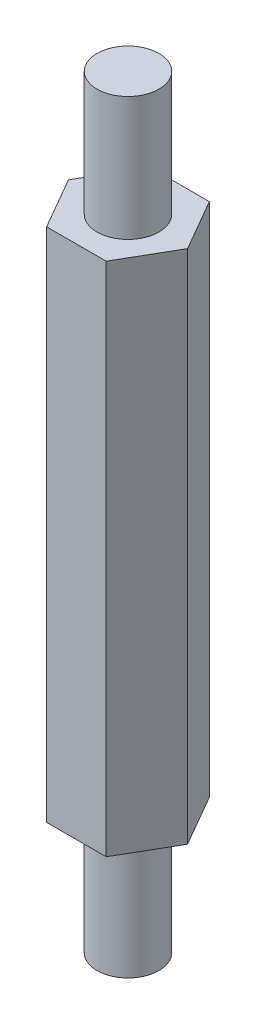
ISO-10303-21;
HEADER;
FILE_DESCRIPTION(('STEP AP214'),'2;1');
FILE_NAME('part.step','',(''),(''),'','','');
FILE_SCHEMA(('AUTOMOTIVE_DESIGN { 1 0 10303 214 1 1 1 1 }'));
ENDSEC;
DATA;
#1=APPLICATION_CONTEXT('core data for automotive mechanical design processes');
#2=APPLICATION_PROTOCOL_DEFINITION('international standard','automotive_design',2000,#1);
#3=PRODUCT_CONTEXT('',#1,'mechanical');
#4=PRODUCT('Part','Part','',(#3));
#5=PRODUCT_RELATED_PRODUCT_CATEGORY('part','',(#4));
#6=PRODUCT_DEFINITION_FORMATION('','',#4);
#7=PRODUCT_DEFINITION_CONTEXT('part definition',#1,'design');
#8=PRODUCT_DEFINITION('design','',#6,#7);
#9=PRODUCT_DEFINITION_SHAPE('','',#8);
#10=(LENGTH_UNIT() NAMED_UNIT(*) SI_UNIT(.MILLI.,.METRE.));
#11=(NAMED_UNIT(*) PLANE_ANGLE_UNIT() SI_UNIT($,.RADIAN.));
#12=(NAMED_UNIT(*) SI_UNIT($,.STERADIAN.) SOLID_ANGLE_UNIT());
#13=UNCERTAINTY_MEASURE_WITH_UNIT(LENGTH_MEASURE(1.E-05),#10,'distance_accuracy_value','');
#14=(GEOMETRIC_REPRESENTATION_CONTEXT(3) GLOBAL_UNCERTAINTY_ASSIGNED_CONTEXT((#13)) GLOBAL_UNIT_ASSIGNED_CONTEXT((#10,
#11,#12)) REPRESENTATION_CONTEXT('',''));
#15=CARTESIAN_POINT('',(0.,0.,0.));
#16=DIRECTION('',(0.,0.,1.));
#17=DIRECTION('',(1.,0.,0.));
#18=AXIS2_PLACEMENT_3D('',#15,#16,#17);
#19=CARTESIAN_POINT('',(0.,-6.,0.));
#20=DIRECTION('',(0.,-1.,0.));
#21=DIRECTION('',(1.,0.,0.));
#22=AXIS2_PLACEMENT_3D('',#19,#20,#21);
#23=PLANE('',#22);
#24=CARTESIAN_POINT('',(0.,-6.,0.));
#25=DIRECTION('',(0.,-1.,0.));
#26=DIRECTION('',(1.,0.,0.));
#27=AXIS2_PLACEMENT_3D('',#24,#25,#26);
#28=CIRCLE('',#27,1.5);
#29=CARTESIAN_POINT('',(1.5,-6.,0.));
#30=VERTEX_POINT('',#29);
#31=EDGE_CURVE('E19',#30,#30,#28,.F.);
#32=ORIENTED_EDGE('',*,*,#31,.F.);
#33=EDGE_LOOP('',(#32));
#34=FACE_BOUND('',#33,.T.);
#35=ADVANCED_FACE('F16',(#34),#23,.T.);
#36=CARTESIAN_POINT('',(1.49999999999999,31.,0.));
#37=DIRECTION('',(0.,1.,0.));
#38=DIRECTION('',(-1.,0.,0.));
#39=AXIS2_PLACEMENT_3D('',#36,#37,#38);
#40=PLANE('',#39);
#41=CARTESIAN_POINT('',(0.,31.,0.));
#42=DIRECTION('',(0.,-1.,0.));
#43=DIRECTION('',(1.,0.,0.));
#44=AXIS2_PLACEMENT_3D('',#41,#42,#43);
#45=CIRCLE('',#44,1.5);
#46=CARTESIAN_POINT('',(1.5,31.,0.));
#47=VERTEX_POINT('',#46);
#48=EDGE_CURVE('E85',#47,#47,#45,.T.);
#49=ORIENTED_EDGE('',*,*,#48,.F.);
#50=EDGE_LOOP('',(#49));
#51=FACE_BOUND('',#50,.T.);
#52=ADVANCED_FACE('F110',(#51),#40,.T.);
#53=CARTESIAN_POINT('',(0.,-3.,0.));
#54=DIRECTION('',(0.,-1.,0.));
#55=DIRECTION('',(1.,0.,0.));
#56=AXIS2_PLACEMENT_3D('',#53,#54,#55);
#57=CYLINDRICAL_SURFACE('',#56,1.5);
#58=CARTESIAN_POINT('',(0.,0.,0.));
#59=DIRECTION('',(0.,-1.,0.));
#60=DIRECTION('',(1.,0.,0.));
#61=AXIS2_PLACEMENT_3D('',#58,#59,#60);
#62=CIRCLE('',#61,1.5);
#63=CARTESIAN_POINT('',(1.5,0.,0.));
#64=VERTEX_POINT('',#63);
#65=EDGE_CURVE('E92',#64,#64,#62,.T.);
#66=ORIENTED_EDGE('',*,*,#65,.T.);
#67=EDGE_LOOP('',(#66));
#68=FACE_BOUND('',#67,.T.);
#69=ORIENTED_EDGE('',*,*,#31,.T.);
#70=EDGE_LOOP('',(#69));
#71=FACE_BOUND('',#70,.T.);
#72=ADVANCED_FACE('F112',(#68,#71),#57,.T.);
#73=CARTESIAN_POINT('',(-1.44337567297406,0.,2.5));
#74=DIRECTION('',(0.,0.,1.));
#75=DIRECTION('',(1.,0.,0.));
#76=AXIS2_PLACEMENT_3D('',#73,#74,#75);
#77=PLANE('',#76);
#78=DIRECTION('',(1.,0.,0.));
#79=VECTOR('',#78,1.);
#80=CARTESIAN_POINT('',(0.,25.,2.5));
#81=LINE('',#80,#79);
#82=CARTESIAN_POINT('',(-1.44337567297406,25.,2.5));
#83=VERTEX_POINT('',#82);
#84=CARTESIAN_POINT('',(1.44337567297407,25.,2.5));
#85=VERTEX_POINT('',#84);
#86=EDGE_CURVE('E234',#83,#85,#81,.T.);
#87=ORIENTED_EDGE('',*,*,#86,.F.);
#88=DIRECTION('',(0.,1.,0.));
#89=VECTOR('',#88,1.);
#90=CARTESIAN_POINT('',(-1.44337567297406,0.,2.5));
#91=LINE('',#90,#89);
#92=CARTESIAN_POINT('',(-1.44337567297406,0.,2.5));
#93=VERTEX_POINT('',#92);
#94=EDGE_CURVE('E76',#93,#83,#91,.T.);
#95=ORIENTED_EDGE('',*,*,#94,.F.);
#96=DIRECTION('',(1.,0.,0.));
#97=VECTOR('',#96,1.);
#98=CARTESIAN_POINT('',(0.,0.,2.5));
#99=LINE('',#98,#97);
#100=CARTESIAN_POINT('',(1.44337567297407,0.,2.5));
#101=VERTEX_POINT('',#100);
#102=EDGE_CURVE('E71',#93,#101,#99,.T.);
#103=ORIENTED_EDGE('',*,*,#102,.T.);
#104=DIRECTION('',(0.,1.,0.));
#105=VECTOR('',#104,1.);
#106=CARTESIAN_POINT('',(1.44337567297407,0.,2.5));
#107=LINE('',#106,#105);
#108=EDGE_CURVE('E74',#85,#101,#107,.F.);
#109=ORIENTED_EDGE('',*,*,#108,.F.);
#110=EDGE_LOOP('',(#87,#95,#103,#109));
#111=FACE_BOUND('',#110,.T.);
#112=ADVANCED_FACE('F73',(#111),#77,.T.);
#113=CARTESIAN_POINT('',(1.44337567297407,0.,2.5));
#114=DIRECTION('',(0.866025403784439,0.,0.499999999999999));
#115=DIRECTION('',(0.499999999999999,0.,-0.866025403784439));
#116=AXIS2_PLACEMENT_3D('',#113,#114,#115);
#117=PLANE('',#116);
#118=DIRECTION('',(0.499999999999998,0.,-0.86602540378444));
#119=VECTOR('',#118,1.);
#120=CARTESIAN_POINT('',(1.44337567297407,25.,2.5));
#121=LINE('',#120,#119);
#122=CARTESIAN_POINT('',(2.88675134594813,25.,0.));
#123=VERTEX_POINT('',#122);
#124=EDGE_CURVE('E83',#85,#123,#121,.T.);
#125=ORIENTED_EDGE('',*,*,#124,.F.);
#126=ORIENTED_EDGE('',*,*,#108,.T.);
#127=DIRECTION('',(0.499999999999998,0.,-0.86602540378444));
#128=VECTOR('',#127,1.);
#129=CARTESIAN_POINT('',(1.44337567297407,0.,2.5));
#130=LINE('',#129,#128);
#131=CARTESIAN_POINT('',(2.88675134594813,0.,0.));
#132=VERTEX_POINT('',#131);
#133=EDGE_CURVE('E66',#101,#132,#130,.T.);
#134=ORIENTED_EDGE('',*,*,#133,.T.);
#135=DIRECTION('',(0.,1.,0.));
#136=VECTOR('',#135,1.);
#137=CARTESIAN_POINT('',(2.88675134594813,0.,0.));
#138=LINE('',#137,#136);
#139=EDGE_CURVE('E79',#123,#132,#138,.F.);
#140=ORIENTED_EDGE('',*,*,#139,.F.);
#141=EDGE_LOOP('',(#125,#126,#134,#140));
#142=FACE_BOUND('',#141,.T.);
#143=ADVANCED_FACE('F81',(#142),#117,.T.);
#144=CARTESIAN_POINT('',(0.,28.,0.));
#145=DIRECTION('',(0.,-1.,0.));
#146=DIRECTION('',(1.,0.,0.));
#147=AXIS2_PLACEMENT_3D('',#144,#145,#146);
#148=CYLINDRICAL_SURFACE('',#147,1.5);
#149=ORIENTED_EDGE('',*,*,#48,.T.);
#150=EDGE_LOOP('',(#149));
#151=FACE_BOUND('',#150,.T.);
#152=CARTESIAN_POINT('',(0.,25.,0.));
#153=DIRECTION('',(0.,-1.,0.));
#154=DIRECTION('',(1.,0.,0.));
#155=AXIS2_PLACEMENT_3D('',#152,#153,#154);
#156=CIRCLE('',#155,1.5);
#157=CARTESIAN_POINT('',(1.5,25.,0.));
#158=VERTEX_POINT('',#157);
#159=EDGE_CURVE('E97',#158,#158,#156,.T.);
#160=ORIENTED_EDGE('',*,*,#159,.F.);
#161=EDGE_LOOP('',(#160));
#162=FACE_BOUND('',#161,.T.);
#163=ADVANCED_FACE('F107',(#151,#162),#148,.T.);
#164=CARTESIAN_POINT('',(2.88675134594813,0.,0.));
#165=DIRECTION('',(0.866025403784438,0.,-0.500000000000001));
#166=DIRECTION('',(-0.500000000000001,0.,-0.866025403784438));
#167=AXIS2_PLACEMENT_3D('',#164,#165,#166);
#168=PLANE('',#167);
#169=DIRECTION('',(-0.500000000000002,0.,-0.866025403784438));
#170=VECTOR('',#169,1.);
#171=CARTESIAN_POINT('',(2.88675134594813,25.,0.));
#172=LINE('',#171,#170);
#173=CARTESIAN_POINT('',(1.44337567297406,25.,-2.5));
#174=VERTEX_POINT('',#173);
#175=EDGE_CURVE('E101',#123,#174,#172,.T.);
#176=ORIENTED_EDGE('',*,*,#175,.F.);
#177=ORIENTED_EDGE('',*,*,#139,.T.);
#178=DIRECTION('',(-0.500000000000002,0.,-0.866025403784438));
#179=VECTOR('',#178,1.);
#180=CARTESIAN_POINT('',(2.88675134594813,0.,0.));
#181=LINE('',#180,#179);
#182=CARTESIAN_POINT('',(1.44337567297406,0.,-2.5));
#183=VERTEX_POINT('',#182);
#184=EDGE_CURVE('E90',#132,#183,#181,.T.);
#185=ORIENTED_EDGE('',*,*,#184,.T.);
#186=DIRECTION('',(0.,1.,0.));
#187=VECTOR('',#186,1.);
#188=CARTESIAN_POINT('',(1.44337567297406,0.,-2.5));
#189=LINE('',#188,#187);
#190=EDGE_CURVE('E231',#174,#183,#189,.F.);
#191=ORIENTED_EDGE('',*,*,#190,.F.);
#192=EDGE_LOOP('',(#176,#177,#185,#191));
#193=FACE_BOUND('',#192,.T.);
#194=ADVANCED_FACE('F143',(#193),#168,.T.);
#195=CARTESIAN_POINT('',(0.,0.,0.));
#196=DIRECTION('',(0.,1.,0.));
#197=DIRECTION('',(0.,0.,1.));
#198=AXIS2_PLACEMENT_3D('',#195,#196,#197);
#199=PLANE('',#198);
#200=ORIENTED_EDGE('',*,*,#65,.F.);
#201=EDGE_LOOP('',(#200));
#202=FACE_BOUND('',#201,.T.);
#203=ORIENTED_EDGE('',*,*,#184,.F.);
#204=ORIENTED_EDGE('',*,*,#133,.F.);
#205=ORIENTED_EDGE('',*,*,#102,.F.);
#206=DIRECTION('',(0.500000000000001,0.,0.866025403784438));
#207=VECTOR('',#206,1.);
#208=CARTESIAN_POINT('',(-2.88675134594813,0.,0.));
#209=LINE('',#208,#207);
#210=CARTESIAN_POINT('',(-2.88675134594813,0.,0.));
#211=VERTEX_POINT('',#210);
#212=EDGE_CURVE('E103',#211,#93,#209,.T.);
#213=ORIENTED_EDGE('',*,*,#212,.F.);
#214=DIRECTION('',(-0.5,0.,0.866025403784439));
#215=VECTOR('',#214,1.);
#216=CARTESIAN_POINT('',(-1.44337567297406,0.,-2.5));
#217=LINE('',#216,#215);
#218=CARTESIAN_POINT('',(-1.44337567297406,0.,-2.5));
#219=VERTEX_POINT('',#218);
#220=EDGE_CURVE('E245',#219,#211,#217,.T.);
#221=ORIENTED_EDGE('',*,*,#220,.F.);
#222=DIRECTION('',(-1.,0.,0.));
#223=VECTOR('',#222,1.);
#224=CARTESIAN_POINT('',(1.44337567297406,0.,-2.5));
#225=LINE('',#224,#223);
#226=EDGE_CURVE('E100',#183,#219,#225,.T.);
#227=ORIENTED_EDGE('',*,*,#226,.F.);
#228=EDGE_LOOP('',(#203,#204,#205,#213,#221,#227));
#229=FACE_BOUND('',#228,.T.);
#230=ADVANCED_FACE('F88',(#202,#229),#199,.F.);
#231=CARTESIAN_POINT('',(-2.88675134594813,0.,0.));
#232=DIRECTION('',(-0.866025403784438,0.,0.500000000000001));
#233=DIRECTION('',(0.500000000000001,0.,0.866025403784438));
#234=AXIS2_PLACEMENT_3D('',#231,#232,#233);
#235=PLANE('',#234);
#236=DIRECTION('',(0.500000000000002,0.,0.866025403784438));
#237=VECTOR('',#236,1.);
#238=CARTESIAN_POINT('',(-2.88675134594813,25.,0.));
#239=LINE('',#238,#237);
#240=CARTESIAN_POINT('',(-2.88675134594813,25.,0.));
#241=VERTEX_POINT('',#240);
#242=EDGE_CURVE('E236',#241,#83,#239,.T.);
#243=ORIENTED_EDGE('',*,*,#242,.F.);
#244=DIRECTION('',(0.,1.,0.));
#245=VECTOR('',#244,1.);
#246=CARTESIAN_POINT('',(-2.88675134594813,0.,0.));
#247=LINE('',#246,#245);
#248=EDGE_CURVE('E243',#211,#241,#247,.T.);
#249=ORIENTED_EDGE('',*,*,#248,.F.);
#250=ORIENTED_EDGE('',*,*,#212,.T.);
#251=ORIENTED_EDGE('',*,*,#94,.T.);
#252=EDGE_LOOP('',(#243,#249,#250,#251));
#253=FACE_BOUND('',#252,.T.);
#254=ADVANCED_FACE('F136',(#253),#235,.T.);
#255=CARTESIAN_POINT('',(0.,25.,0.));
#256=DIRECTION('',(0.,1.,0.));
#257=DIRECTION('',(0.,0.,1.));
#258=AXIS2_PLACEMENT_3D('',#255,#256,#257);
#259=PLANE('',#258);
#260=ORIENTED_EDGE('',*,*,#159,.T.);
#261=EDGE_LOOP('',(#260));
#262=FACE_BOUND('',#261,.T.);
#263=ORIENTED_EDGE('',*,*,#124,.T.);
#264=ORIENTED_EDGE('',*,*,#175,.T.);
#265=DIRECTION('',(-1.,0.,0.));
#266=VECTOR('',#265,1.);
#267=CARTESIAN_POINT('',(1.44337567297406,25.,-2.5));
#268=LINE('',#267,#266);
#269=CARTESIAN_POINT('',(-1.44337567297406,25.,-2.5));
#270=VERTEX_POINT('',#269);
#271=EDGE_CURVE('E34',#270,#174,#268,.F.);
#272=ORIENTED_EDGE('',*,*,#271,.F.);
#273=DIRECTION('',(-0.5,0.,0.866025403784439));
#274=VECTOR('',#273,1.);
#275=CARTESIAN_POINT('',(-1.44337567297406,25.,-2.5));
#276=LINE('',#275,#274);
#277=EDGE_CURVE('E25',#241,#270,#276,.F.);
#278=ORIENTED_EDGE('',*,*,#277,.F.);
#279=ORIENTED_EDGE('',*,*,#242,.T.);
#280=ORIENTED_EDGE('',*,*,#86,.T.);
#281=EDGE_LOOP('',(#263,#264,#272,#278,#279,#280));
#282=FACE_BOUND('',#281,.T.);
#283=ADVANCED_FACE('F129',(#262,#282),#259,.T.);
#284=CARTESIAN_POINT('',(1.44337567297406,0.,-2.5));
#285=DIRECTION('',(0.,0.,-1.));
#286=DIRECTION('',(-1.,0.,0.));
#287=AXIS2_PLACEMENT_3D('',#284,#285,#286);
#288=PLANE('',#287);
#289=ORIENTED_EDGE('',*,*,#271,.T.);
#290=ORIENTED_EDGE('',*,*,#190,.T.);
#291=ORIENTED_EDGE('',*,*,#226,.T.);
#292=DIRECTION('',(0.,1.,0.));
#293=VECTOR('',#292,1.);
#294=CARTESIAN_POINT('',(-1.44337567297406,0.,-2.5));
#295=LINE('',#294,#293);
#296=EDGE_CURVE('E11',#270,#219,#295,.F.);
#297=ORIENTED_EDGE('',*,*,#296,.F.);
#298=EDGE_LOOP('',(#289,#290,#291,#297));
#299=FACE_BOUND('',#298,.T.);
#300=ADVANCED_FACE('F123',(#299),#288,.T.);
#301=CARTESIAN_POINT('',(-1.44337567297406,0.,-2.5));
#302=DIRECTION('',(-0.866025403784439,0.,-0.5));
#303=DIRECTION('',(-0.5,0.,0.866025403784439));
#304=AXIS2_PLACEMENT_3D('',#301,#302,#303);
#305=PLANE('',#304);
#306=ORIENTED_EDGE('',*,*,#277,.T.);
#307=ORIENTED_EDGE('',*,*,#296,.T.);
#308=ORIENTED_EDGE('',*,*,#220,.T.);
#309=ORIENTED_EDGE('',*,*,#248,.T.);
#310=EDGE_LOOP('',(#306,#307,#308,#309));
#311=FACE_BOUND('',#310,.T.);
#312=ADVANCED_FACE('F121',(#311),#305,.T.);
#313=CLOSED_SHELL('',(#35,#52,#72,#112,#143,#163,#194,#230,#254,#283,#300,#312));
#314=MANIFOLD_SOLID_BREP('B1',#313);
#315=ADVANCED_BREP_SHAPE_REPRESENTATION('',(#18,#314),#14);
#316=SHAPE_DEFINITION_REPRESENTATION(#9,#315);
ENDSEC;
END-ISO-10303-21;
